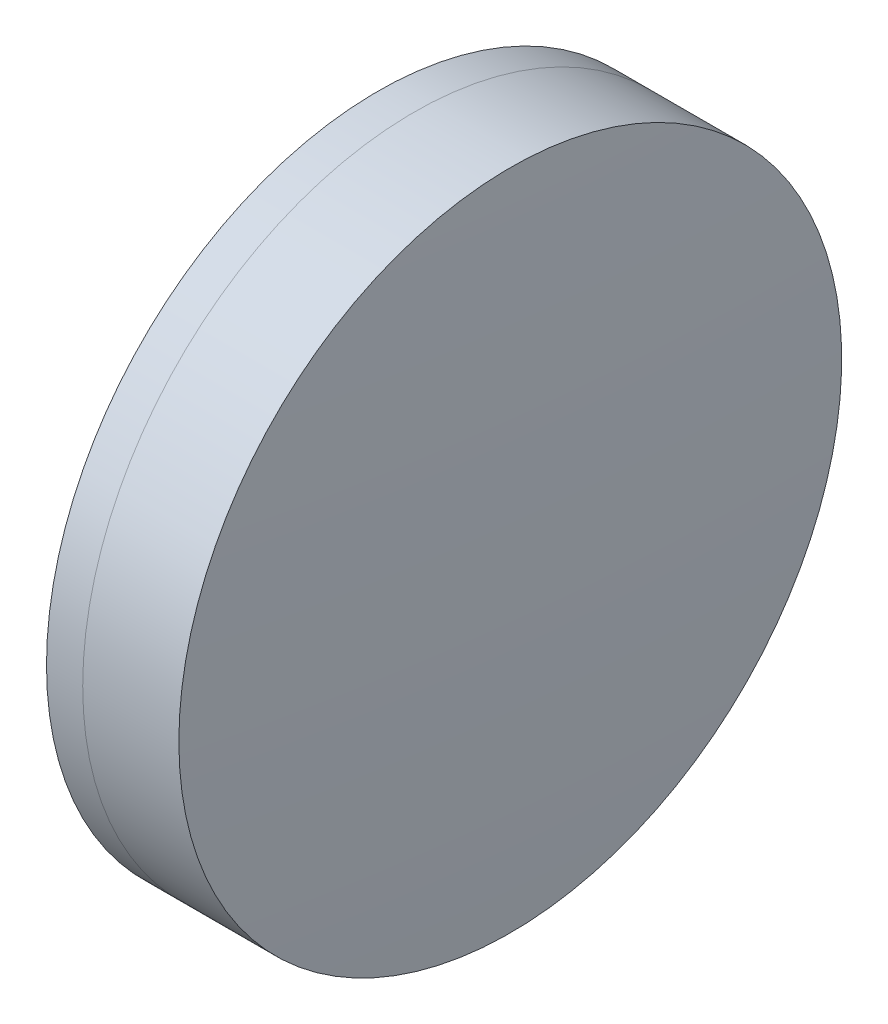
ISO-10303-21;
HEADER;
FILE_DESCRIPTION(('STEP AP214'),'2;1');
FILE_NAME('part.step','',(''),(''),'','','');
FILE_SCHEMA(('AUTOMOTIVE_DESIGN { 1 0 10303 214 1 1 1 1 }'));
ENDSEC;
DATA;
#1=APPLICATION_CONTEXT('core data for automotive mechanical design processes');
#2=APPLICATION_PROTOCOL_DEFINITION('international standard','automotive_design',2000,#1);
#3=PRODUCT_CONTEXT('',#1,'mechanical');
#4=PRODUCT('Part','Part','',(#3));
#5=PRODUCT_RELATED_PRODUCT_CATEGORY('part','',(#4));
#6=PRODUCT_DEFINITION_FORMATION('','',#4);
#7=PRODUCT_DEFINITION_CONTEXT('part definition',#1,'design');
#8=PRODUCT_DEFINITION('design','',#6,#7);
#9=PRODUCT_DEFINITION_SHAPE('','',#8);
#10=(LENGTH_UNIT() NAMED_UNIT(*) SI_UNIT(.MILLI.,.METRE.));
#11=(NAMED_UNIT(*) PLANE_ANGLE_UNIT() SI_UNIT($,.RADIAN.));
#12=(NAMED_UNIT(*) SI_UNIT($,.STERADIAN.) SOLID_ANGLE_UNIT());
#13=UNCERTAINTY_MEASURE_WITH_UNIT(LENGTH_MEASURE(1.E-05),#10,'distance_accuracy_value','');
#14=(GEOMETRIC_REPRESENTATION_CONTEXT(3) GLOBAL_UNCERTAINTY_ASSIGNED_CONTEXT((#13)) GLOBAL_UNIT_ASSIGNED_CONTEXT((#10,
#11,#12)) REPRESENTATION_CONTEXT('',''));
#15=CARTESIAN_POINT('',(0.,0.,0.));
#16=DIRECTION('',(0.,0.,1.));
#17=DIRECTION('',(1.,0.,0.));
#18=AXIS2_PLACEMENT_3D('',#15,#16,#17);
#19=CARTESIAN_POINT('',(457.780559274323,0.,0.));
#20=DIRECTION('',(-1.,0.,0.));
#21=DIRECTION('',(0.,0.,1.));
#22=AXIS2_PLACEMENT_3D('',#19,#20,#21);
#23=SPHERICAL_SURFACE('',#22,109.2);
#24=CARTESIAN_POINT('',(563.985455583297,0.,0.));
#25=DIRECTION('',(-1.,0.,0.));
#26=DIRECTION('',(0.,0.,1.));
#27=AXIS2_PLACEMENT_3D('',#24,#25,#26);
#28=CIRCLE('',#27,25.4);
#29=CARTESIAN_POINT('',(563.985455583297,0.,25.4));
#30=VERTEX_POINT('',#29);
#31=EDGE_CURVE('E11',#30,#30,#28,.T.);
#32=ORIENTED_EDGE('',*,*,#31,.T.);
#33=EDGE_LOOP('',(#32));
#34=FACE_BOUND('',#33,.T.);
#35=ADVANCED_FACE('F45',(#34),#23,.F.);
#36=CARTESIAN_POINT('',(-0.551919992657797,0.,0.));
#37=DIRECTION('',(-1.,0.,0.));
#38=DIRECTION('',(0.,0.,1.));
#39=AXIS2_PLACEMENT_3D('',#36,#37,#38);
#40=CYLINDRICAL_SURFACE('',#39,25.4);
#41=CARTESIAN_POINT('',(571.354052567555,0.,0.));
#42=DIRECTION('',(-1.,0.,0.));
#43=DIRECTION('',(0.,0.,1.));
#44=AXIS2_PLACEMENT_3D('',#41,#42,#43);
#45=CIRCLE('',#44,25.4);
#46=CARTESIAN_POINT('',(571.354052567555,0.,25.4));
#47=VERTEX_POINT('',#46);
#48=EDGE_CURVE('E51',#47,#47,#45,.T.);
#49=ORIENTED_EDGE('',*,*,#48,.T.);
#50=EDGE_LOOP('',(#49));
#51=FACE_BOUND('',#50,.T.);
#52=ORIENTED_EDGE('',*,*,#31,.F.);
#53=EDGE_LOOP('',(#52));
#54=FACE_BOUND('',#53,.T.);
#55=ADVANCED_FACE('F57',(#51,#54),#40,.T.);
#56=CARTESIAN_POINT('',(56.7805592743231,0.,0.));
#57=DIRECTION('',(-1.,0.,0.));
#58=DIRECTION('',(0.,0.,1.));
#59=AXIS2_PLACEMENT_3D('',#56,#57,#58);
#60=SPHERICAL_SURFACE('',#59,515.2);
#61=ORIENTED_EDGE('',*,*,#48,.F.);
#62=EDGE_LOOP('',(#61));
#63=FACE_BOUND('',#62,.T.);
#64=ADVANCED_FACE('F60',(#63),#60,.T.);
#65=CLOSED_SHELL('',(#35,#55,#64));
#66=MANIFOLD_SOLID_BREP('B2',#65);
#67=CARTESIAN_POINT('',(692.780559274323,0.,0.));
#68=DIRECTION('',(-1.,0.,0.));
#69=DIRECTION('',(0.,0.,1.));
#70=AXIS2_PLACEMENT_3D('',#67,#68,#69);
#71=SPHERICAL_SURFACE('',#70,134.);
#72=CARTESIAN_POINT('',(561.209893850757,0.,0.));
#73=DIRECTION('',(-1.,0.,0.));
#74=DIRECTION('',(0.,0.,1.));
#75=AXIS2_PLACEMENT_3D('',#72,#73,#74);
#76=CIRCLE('',#75,25.4);
#77=CARTESIAN_POINT('',(561.209893850757,0.,25.4));
#78=VERTEX_POINT('',#77);
#79=EDGE_CURVE('E44',#78,#78,#76,.T.);
#80=ORIENTED_EDGE('',*,*,#79,.T.);
#81=EDGE_LOOP('',(#80));
#82=FACE_BOUND('',#81,.T.);
#83=ADVANCED_FACE('F86',(#82),#71,.T.);
#84=CARTESIAN_POINT('',(124.523309526045,0.,0.));
#85=DIRECTION('',(-1.,0.,0.));
#86=DIRECTION('',(0.,0.,1.));
#87=AXIS2_PLACEMENT_3D('',#84,#85,#86);
#88=CYLINDRICAL_SURFACE('',#87,25.4);
#89=CARTESIAN_POINT('',(563.985455583297,0.,0.));
#90=DIRECTION('',(-1.,0.,0.));
#91=DIRECTION('',(0.,0.,1.));
#92=AXIS2_PLACEMENT_3D('',#89,#90,#91);
#93=CIRCLE('',#92,25.4);
#94=CARTESIAN_POINT('',(563.985455583297,0.,25.4));
#95=VERTEX_POINT('',#94);
#96=EDGE_CURVE('E92',#95,#95,#93,.T.);
#97=ORIENTED_EDGE('',*,*,#96,.T.);
#98=EDGE_LOOP('',(#97));
#99=FACE_BOUND('',#98,.T.);
#100=ORIENTED_EDGE('',*,*,#79,.F.);
#101=EDGE_LOOP('',(#100));
#102=FACE_BOUND('',#101,.T.);
#103=ADVANCED_FACE('F98',(#99,#102),#88,.T.);
#104=CARTESIAN_POINT('',(457.780559274323,0.,0.));
#105=DIRECTION('',(-1.,0.,0.));
#106=DIRECTION('',(0.,0.,1.));
#107=AXIS2_PLACEMENT_3D('',#104,#105,#106);
#108=SPHERICAL_SURFACE('',#107,109.2);
#109=ORIENTED_EDGE('',*,*,#96,.F.);
#110=EDGE_LOOP('',(#109));
#111=FACE_BOUND('',#110,.T.);
#112=ADVANCED_FACE('F101',(#111),#108,.T.);
#113=CLOSED_SHELL('',(#83,#103,#112));
#114=MANIFOLD_SOLID_BREP('B6',#113);
#115=ADVANCED_BREP_SHAPE_REPRESENTATION('',(#18,#66,#114),#14);
#116=SHAPE_DEFINITION_REPRESENTATION(#9,#115);
ENDSEC;
END-ISO-10303-21;
